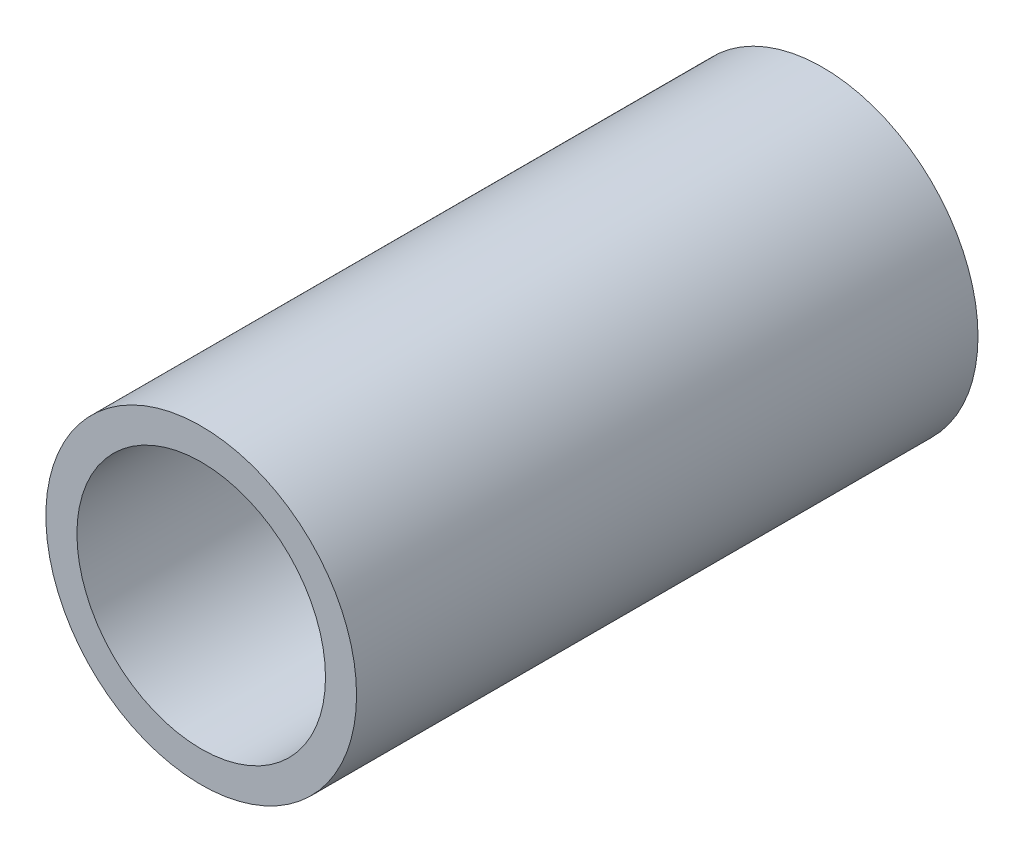
ISO-10303-21;
HEADER;
FILE_DESCRIPTION(('STEP AP214'),'2;1');
FILE_NAME('part.step','',(''),(''),'','','');
FILE_SCHEMA(('AUTOMOTIVE_DESIGN { 1 0 10303 214 1 1 1 1 }'));
ENDSEC;
DATA;
#1=APPLICATION_CONTEXT('core data for automotive mechanical design processes');
#2=APPLICATION_PROTOCOL_DEFINITION('international standard','automotive_design',2000,#1);
#3=PRODUCT_CONTEXT('',#1,'mechanical');
#4=PRODUCT('Part','Part','',(#3));
#5=PRODUCT_RELATED_PRODUCT_CATEGORY('part','',(#4));
#6=PRODUCT_DEFINITION_FORMATION('','',#4);
#7=PRODUCT_DEFINITION_CONTEXT('part definition',#1,'design');
#8=PRODUCT_DEFINITION('design','',#6,#7);
#9=PRODUCT_DEFINITION_SHAPE('','',#8);
#10=(LENGTH_UNIT() NAMED_UNIT(*) SI_UNIT(.MILLI.,.METRE.));
#11=(NAMED_UNIT(*) PLANE_ANGLE_UNIT() SI_UNIT($,.RADIAN.));
#12=(NAMED_UNIT(*) SI_UNIT($,.STERADIAN.) SOLID_ANGLE_UNIT());
#13=UNCERTAINTY_MEASURE_WITH_UNIT(LENGTH_MEASURE(1.E-05),#10,'distance_accuracy_value','');
#14=(GEOMETRIC_REPRESENTATION_CONTEXT(3) GLOBAL_UNCERTAINTY_ASSIGNED_CONTEXT((#13)) GLOBAL_UNIT_ASSIGNED_CONTEXT((#10,
#11,#12)) REPRESENTATION_CONTEXT('',''));
#15=CARTESIAN_POINT('',(0.,0.,0.));
#16=DIRECTION('',(0.,0.,1.));
#17=DIRECTION('',(1.,0.,0.));
#18=AXIS2_PLACEMENT_3D('',#15,#16,#17);
#19=CARTESIAN_POINT('',(0.,0.,200.));
#20=DIRECTION('',(0.,0.,1.));
#21=DIRECTION('',(1.,0.,0.));
#22=AXIS2_PLACEMENT_3D('',#19,#20,#21);
#23=PLANE('',#22);
#24=CARTESIAN_POINT('',(0.,0.,200.));
#25=DIRECTION('',(0.,0.,1.));
#26=DIRECTION('',(1.,0.,0.));
#27=AXIS2_PLACEMENT_3D('',#24,#25,#26);
#28=CIRCLE('',#27,50.);
#29=CARTESIAN_POINT('',(50.,0.,200.));
#30=VERTEX_POINT('',#29);
#31=EDGE_CURVE('E10',#30,#30,#28,.T.);
#32=ORIENTED_EDGE('',*,*,#31,.T.);
#33=EDGE_LOOP('',(#32));
#34=FACE_BOUND('',#33,.T.);
#35=CARTESIAN_POINT('',(0.,0.,200.));
#36=DIRECTION('',(0.,0.,1.));
#37=DIRECTION('',(1.,0.,0.));
#38=AXIS2_PLACEMENT_3D('',#35,#36,#37);
#39=CIRCLE('',#38,40.);
#40=CARTESIAN_POINT('',(40.,0.,200.));
#41=VERTEX_POINT('',#40);
#42=EDGE_CURVE('E38',#41,#41,#39,.T.);
#43=ORIENTED_EDGE('',*,*,#42,.F.);
#44=EDGE_LOOP('',(#43));
#45=FACE_BOUND('',#44,.T.);
#46=ADVANCED_FACE('F27',(#34,#45),#23,.T.);
#47=CARTESIAN_POINT('',(0.,0.,0.));
#48=DIRECTION('',(0.,0.,1.));
#49=DIRECTION('',(1.,0.,0.));
#50=AXIS2_PLACEMENT_3D('',#47,#48,#49);
#51=PLANE('',#50);
#52=CARTESIAN_POINT('',(0.,0.,0.));
#53=DIRECTION('',(0.,0.,1.));
#54=DIRECTION('',(1.,0.,0.));
#55=AXIS2_PLACEMENT_3D('',#52,#53,#54);
#56=CIRCLE('',#55,50.);
#57=CARTESIAN_POINT('',(50.,0.,0.));
#58=VERTEX_POINT('',#57);
#59=EDGE_CURVE('E34',#58,#58,#56,.T.);
#60=ORIENTED_EDGE('',*,*,#59,.F.);
#61=EDGE_LOOP('',(#60));
#62=FACE_BOUND('',#61,.T.);
#63=CARTESIAN_POINT('',(0.,0.,0.));
#64=DIRECTION('',(0.,0.,1.));
#65=DIRECTION('',(1.,0.,0.));
#66=AXIS2_PLACEMENT_3D('',#63,#64,#65);
#67=CIRCLE('',#66,40.);
#68=CARTESIAN_POINT('',(40.,0.,0.));
#69=VERTEX_POINT('',#68);
#70=EDGE_CURVE('E42',#69,#69,#67,.T.);
#71=ORIENTED_EDGE('',*,*,#70,.T.);
#72=EDGE_LOOP('',(#71));
#73=FACE_BOUND('',#72,.T.);
#74=ADVANCED_FACE('F48',(#62,#73),#51,.F.);
#75=CARTESIAN_POINT('',(0.,0.,200.));
#76=DIRECTION('',(0.,0.,-1.));
#77=DIRECTION('',(-1.,0.,0.));
#78=AXIS2_PLACEMENT_3D('',#75,#76,#77);
#79=CYLINDRICAL_SURFACE('',#78,50.);
#80=ORIENTED_EDGE('',*,*,#31,.F.);
#81=EDGE_LOOP('',(#80));
#82=FACE_BOUND('',#81,.T.);
#83=ORIENTED_EDGE('',*,*,#59,.T.);
#84=EDGE_LOOP('',(#83));
#85=FACE_BOUND('',#84,.T.);
#86=ADVANCED_FACE('F29',(#82,#85),#79,.T.);
#87=CARTESIAN_POINT('',(0.,0.,200.));
#88=DIRECTION('',(0.,0.,-1.));
#89=DIRECTION('',(-1.,0.,0.));
#90=AXIS2_PLACEMENT_3D('',#87,#88,#89);
#91=CYLINDRICAL_SURFACE('',#90,40.);
#92=ORIENTED_EDGE('',*,*,#42,.T.);
#93=EDGE_LOOP('',(#92));
#94=FACE_BOUND('',#93,.T.);
#95=ORIENTED_EDGE('',*,*,#70,.F.);
#96=EDGE_LOOP('',(#95));
#97=FACE_BOUND('',#96,.T.);
#98=ADVANCED_FACE('F50',(#94,#97),#91,.F.);
#99=CLOSED_SHELL('',(#46,#74,#86,#98));
#100=MANIFOLD_SOLID_BREP('B2',#99);
#101=ADVANCED_BREP_SHAPE_REPRESENTATION('',(#18,#100),#14);
#102=SHAPE_DEFINITION_REPRESENTATION(#9,#101);
ENDSEC;
END-ISO-10303-21;
